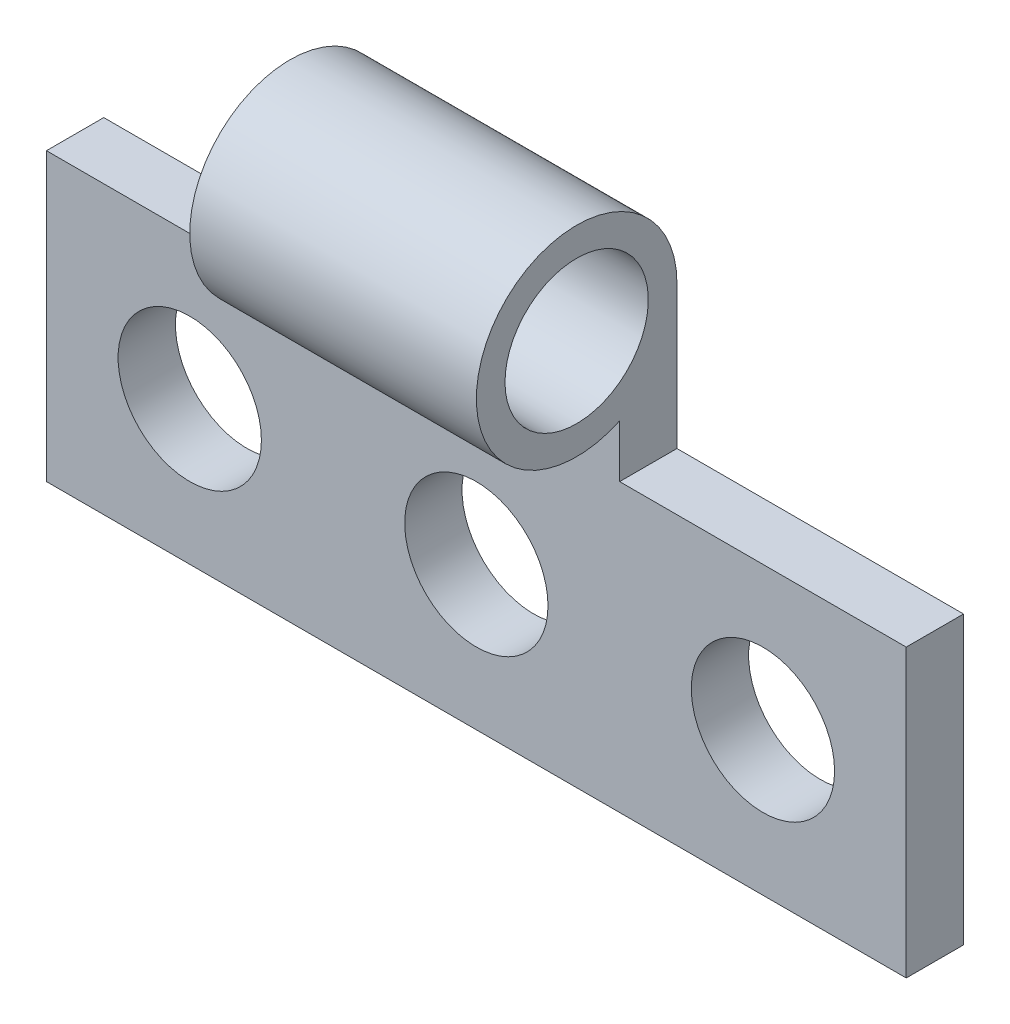
ISO-10303-21;
HEADER;
FILE_DESCRIPTION(('STEP AP214'),'2;1');
FILE_NAME('part.step','',(''),(''),'','','');
FILE_SCHEMA(('AUTOMOTIVE_DESIGN { 1 0 10303 214 1 1 1 1 }'));
ENDSEC;
DATA;
#1=APPLICATION_CONTEXT('core data for automotive mechanical design processes');
#2=APPLICATION_PROTOCOL_DEFINITION('international standard','automotive_design',2000,#1);
#3=PRODUCT_CONTEXT('',#1,'mechanical');
#4=PRODUCT('Part','Part','',(#3));
#5=PRODUCT_RELATED_PRODUCT_CATEGORY('part','',(#4));
#6=PRODUCT_DEFINITION_FORMATION('','',#4);
#7=PRODUCT_DEFINITION_CONTEXT('part definition',#1,'design');
#8=PRODUCT_DEFINITION('design','',#6,#7);
#9=PRODUCT_DEFINITION_SHAPE('','',#8);
#10=(LENGTH_UNIT() NAMED_UNIT(*) SI_UNIT(.MILLI.,.METRE.));
#11=(NAMED_UNIT(*) PLANE_ANGLE_UNIT() SI_UNIT($,.RADIAN.));
#12=(NAMED_UNIT(*) SI_UNIT($,.STERADIAN.) SOLID_ANGLE_UNIT());
#13=UNCERTAINTY_MEASURE_WITH_UNIT(LENGTH_MEASURE(1.E-05),#10,'distance_accuracy_value','');
#14=(GEOMETRIC_REPRESENTATION_CONTEXT(3) GLOBAL_UNCERTAINTY_ASSIGNED_CONTEXT((#13)) GLOBAL_UNIT_ASSIGNED_CONTEXT((#10,
#11,#12)) REPRESENTATION_CONTEXT('',''));
#15=CARTESIAN_POINT('',(0.,0.,0.));
#16=DIRECTION('',(0.,0.,1.));
#17=DIRECTION('',(1.,0.,0.));
#18=AXIS2_PLACEMENT_3D('',#15,#16,#17);
#19=CARTESIAN_POINT('',(-15.,5.,2.));
#20=DIRECTION('',(0.,-1.,0.));
#21=DIRECTION('',(0.,0.,-1.));
#22=AXIS2_PLACEMENT_3D('',#19,#20,#21);
#23=PLANE('',#22);
#24=DIRECTION('',(0.,0.,1.));
#25=VECTOR('',#24,1.);
#26=CARTESIAN_POINT('',(-5.,5.,0.));
#27=LINE('',#26,#25);
#28=CARTESIAN_POINT('',(-5.,5.,0.));
#29=VERTEX_POINT('',#28);
#30=CARTESIAN_POINT('',(-5.,5.,2.));
#31=VERTEX_POINT('',#30);
#32=EDGE_CURVE('E63',#29,#31,#27,.T.);
#33=ORIENTED_EDGE('',*,*,#32,.F.);
#34=DIRECTION('',(-1.,0.,0.));
#35=VECTOR('',#34,1.);
#36=CARTESIAN_POINT('',(-15.,5.,0.));
#37=LINE('',#36,#35);
#38=CARTESIAN_POINT('',(-15.,5.,0.));
#39=VERTEX_POINT('',#38);
#40=EDGE_CURVE('E158',#29,#39,#37,.T.);
#41=ORIENTED_EDGE('',*,*,#40,.T.);
#42=DIRECTION('',(0.,0.,-1.));
#43=VECTOR('',#42,1.);
#44=CARTESIAN_POINT('',(-15.,5.,2.));
#45=LINE('',#44,#43);
#46=CARTESIAN_POINT('',(-15.,5.,2.));
#47=VERTEX_POINT('',#46);
#48=EDGE_CURVE('E47',#47,#39,#45,.T.);
#49=ORIENTED_EDGE('',*,*,#48,.F.);
#50=DIRECTION('',(-1.,0.,0.));
#51=VECTOR('',#50,1.);
#52=CARTESIAN_POINT('',(-15.,5.,2.));
#53=LINE('',#52,#51);
#54=EDGE_CURVE('E148',#31,#47,#53,.T.);
#55=ORIENTED_EDGE('',*,*,#54,.F.);
#56=EDGE_LOOP('',(#33,#41,#49,#55));
#57=FACE_BOUND('',#56,.T.);
#58=ADVANCED_FACE('F38',(#57),#23,.F.);
#59=CARTESIAN_POINT('',(15.,5.,2.));
#60=DIRECTION('',(-1.,0.,0.));
#61=DIRECTION('',(0.,0.,1.));
#62=AXIS2_PLACEMENT_3D('',#59,#60,#61);
#63=PLANE('',#62);
#64=DIRECTION('',(0.,1.,0.));
#65=VECTOR('',#64,1.);
#66=CARTESIAN_POINT('',(15.,5.,0.));
#67=LINE('',#66,#65);
#68=CARTESIAN_POINT('',(15.,-5.,0.));
#69=VERTEX_POINT('',#68);
#70=CARTESIAN_POINT('',(15.,5.,0.));
#71=VERTEX_POINT('',#70);
#72=EDGE_CURVE('E116',#69,#71,#67,.T.);
#73=ORIENTED_EDGE('',*,*,#72,.T.);
#74=DIRECTION('',(0.,0.,-1.));
#75=VECTOR('',#74,1.);
#76=CARTESIAN_POINT('',(15.,5.,2.));
#77=LINE('',#76,#75);
#78=CARTESIAN_POINT('',(15.,5.,2.));
#79=VERTEX_POINT('',#78);
#80=EDGE_CURVE('E11',#79,#71,#77,.T.);
#81=ORIENTED_EDGE('',*,*,#80,.F.);
#82=DIRECTION('',(0.,1.,0.));
#83=VECTOR('',#82,1.);
#84=CARTESIAN_POINT('',(15.,5.,2.));
#85=LINE('',#84,#83);
#86=CARTESIAN_POINT('',(15.,-5.,2.));
#87=VERTEX_POINT('',#86);
#88=EDGE_CURVE('E146',#87,#79,#85,.T.);
#89=ORIENTED_EDGE('',*,*,#88,.F.);
#90=DIRECTION('',(0.,0.,-1.));
#91=VECTOR('',#90,1.);
#92=CARTESIAN_POINT('',(15.,-5.,2.));
#93=LINE('',#92,#91);
#94=EDGE_CURVE('E155',#87,#69,#93,.T.);
#95=ORIENTED_EDGE('',*,*,#94,.T.);
#96=EDGE_LOOP('',(#73,#81,#89,#95));
#97=FACE_BOUND('',#96,.T.);
#98=ADVANCED_FACE('F40',(#97),#63,.F.);
#99=CARTESIAN_POINT('',(4.99999999999999,5.,0.));
#100=VERTEX_POINT('',#99);
#101=EDGE_CURVE('E159',#71,#100,#37,.T.);
#102=ORIENTED_EDGE('',*,*,#101,.T.);
#103=DIRECTION('',(0.,0.,1.));
#104=VECTOR('',#103,1.);
#105=CARTESIAN_POINT('',(5.,5.,0.));
#106=LINE('',#105,#104);
#107=CARTESIAN_POINT('',(4.99999999999999,5.,2.));
#108=VERTEX_POINT('',#107);
#109=EDGE_CURVE('E55',#100,#108,#106,.T.);
#110=ORIENTED_EDGE('',*,*,#109,.T.);
#111=EDGE_CURVE('E128',#79,#108,#53,.T.);
#112=ORIENTED_EDGE('',*,*,#111,.F.);
#113=ORIENTED_EDGE('',*,*,#80,.T.);
#114=EDGE_LOOP('',(#102,#110,#112,#113));
#115=FACE_BOUND('',#114,.T.);
#116=ADVANCED_FACE('F235',(#115),#23,.F.);
#117=CARTESIAN_POINT('',(-15.,5.,2.));
#118=DIRECTION('',(1.,0.,0.));
#119=DIRECTION('',(0.,1.,0.));
#120=AXIS2_PLACEMENT_3D('',#117,#118,#119);
#121=PLANE('',#120);
#122=DIRECTION('',(0.,-1.,0.));
#123=VECTOR('',#122,1.);
#124=CARTESIAN_POINT('',(-15.,5.,0.));
#125=LINE('',#124,#123);
#126=CARTESIAN_POINT('',(-15.,-5.,0.));
#127=VERTEX_POINT('',#126);
#128=EDGE_CURVE('E161',#39,#127,#125,.T.);
#129=ORIENTED_EDGE('',*,*,#128,.T.);
#130=DIRECTION('',(0.,0.,-1.));
#131=VECTOR('',#130,1.);
#132=CARTESIAN_POINT('',(-15.,-5.,2.));
#133=LINE('',#132,#131);
#134=CARTESIAN_POINT('',(-15.,-5.,2.));
#135=VERTEX_POINT('',#134);
#136=EDGE_CURVE('E166',#135,#127,#133,.T.);
#137=ORIENTED_EDGE('',*,*,#136,.F.);
#138=DIRECTION('',(0.,-1.,0.));
#139=VECTOR('',#138,1.);
#140=CARTESIAN_POINT('',(-15.,5.,2.));
#141=LINE('',#140,#139);
#142=EDGE_CURVE('E151',#47,#135,#141,.T.);
#143=ORIENTED_EDGE('',*,*,#142,.F.);
#144=ORIENTED_EDGE('',*,*,#48,.T.);
#145=EDGE_LOOP('',(#129,#137,#143,#144));
#146=FACE_BOUND('',#145,.T.);
#147=ADVANCED_FACE('F229',(#146),#121,.F.);
#148=CARTESIAN_POINT('',(-15.,-5.,2.));
#149=DIRECTION('',(0.,1.,0.));
#150=DIRECTION('',(0.,0.,1.));
#151=AXIS2_PLACEMENT_3D('',#148,#149,#150);
#152=PLANE('',#151);
#153=DIRECTION('',(1.,0.,0.));
#154=VECTOR('',#153,1.);
#155=CARTESIAN_POINT('',(-15.,-5.,0.));
#156=LINE('',#155,#154);
#157=EDGE_CURVE('E149',#127,#69,#156,.T.);
#158=ORIENTED_EDGE('',*,*,#157,.T.);
#159=ORIENTED_EDGE('',*,*,#94,.F.);
#160=DIRECTION('',(1.,0.,0.));
#161=VECTOR('',#160,1.);
#162=CARTESIAN_POINT('',(-15.,-5.,2.));
#163=LINE('',#162,#161);
#164=EDGE_CURVE('E153',#135,#87,#163,.T.);
#165=ORIENTED_EDGE('',*,*,#164,.F.);
#166=ORIENTED_EDGE('',*,*,#136,.T.);
#167=EDGE_LOOP('',(#158,#159,#165,#166));
#168=FACE_BOUND('',#167,.T.);
#169=ADVANCED_FACE('F200',(#168),#152,.F.);
#170=CARTESIAN_POINT('',(0.,0.,2.));
#171=DIRECTION('',(0.,0.,1.));
#172=DIRECTION('',(1.,0.,0.));
#173=AXIS2_PLACEMENT_3D('',#170,#171,#172);
#174=PLANE('',#173);
#175=CARTESIAN_POINT('',(-9.99999999999999,0.,2.));
#176=DIRECTION('',(0.,0.,1.));
#177=DIRECTION('',(1.,0.,0.));
#178=AXIS2_PLACEMENT_3D('',#175,#176,#177);
#179=CIRCLE('',#178,2.5);
#180=CARTESIAN_POINT('',(-7.49999999999999,0.,2.));
#181=VERTEX_POINT('',#180);
#182=EDGE_CURVE('E174',#181,#181,#179,.T.);
#183=ORIENTED_EDGE('',*,*,#182,.F.);
#184=EDGE_LOOP('',(#183));
#185=FACE_BOUND('',#184,.T.);
#186=CARTESIAN_POINT('',(0.,0.,2.));
#187=DIRECTION('',(0.,0.,1.));
#188=DIRECTION('',(1.,0.,0.));
#189=AXIS2_PLACEMENT_3D('',#186,#187,#188);
#190=CIRCLE('',#189,2.5);
#191=CARTESIAN_POINT('',(2.50000000000001,0.,2.));
#192=VERTEX_POINT('',#191);
#193=EDGE_CURVE('E188',#192,#192,#190,.T.);
#194=ORIENTED_EDGE('',*,*,#193,.F.);
#195=EDGE_LOOP('',(#194));
#196=FACE_BOUND('',#195,.T.);
#197=CARTESIAN_POINT('',(10.,0.,2.));
#198=DIRECTION('',(0.,0.,1.));
#199=DIRECTION('',(1.,0.,0.));
#200=AXIS2_PLACEMENT_3D('',#197,#198,#199);
#201=CIRCLE('',#200,2.5);
#202=CARTESIAN_POINT('',(12.5,0.,2.));
#203=VERTEX_POINT('',#202);
#204=EDGE_CURVE('E185',#203,#203,#201,.T.);
#205=ORIENTED_EDGE('',*,*,#204,.F.);
#206=EDGE_LOOP('',(#205));
#207=FACE_BOUND('',#206,.T.);
#208=ORIENTED_EDGE('',*,*,#88,.T.);
#209=ORIENTED_EDGE('',*,*,#111,.T.);
#210=DIRECTION('',(0.,1.,0.));
#211=VECTOR('',#210,1.);
#212=CARTESIAN_POINT('',(5.,5.,2.));
#213=LINE('',#212,#211);
#214=CARTESIAN_POINT('',(5.,6.83772233983162,2.));
#215=VERTEX_POINT('',#214);
#216=EDGE_CURVE('E122',#108,#215,#213,.T.);
#217=ORIENTED_EDGE('',*,*,#216,.T.);
#218=DIRECTION('',(1.,0.,0.));
#219=VECTOR('',#218,1.);
#220=CARTESIAN_POINT('',(-5.,6.83772233983162,2.));
#221=LINE('',#220,#219);
#222=CARTESIAN_POINT('',(-5.,6.83772233983162,2.));
#223=VERTEX_POINT('',#222);
#224=EDGE_CURVE('E106',#223,#215,#221,.T.);
#225=ORIENTED_EDGE('',*,*,#224,.F.);
#226=DIRECTION('',(0.,1.,0.));
#227=VECTOR('',#226,1.);
#228=CARTESIAN_POINT('',(-5.,5.,2.));
#229=LINE('',#228,#227);
#230=EDGE_CURVE('E139',#31,#223,#229,.T.);
#231=ORIENTED_EDGE('',*,*,#230,.F.);
#232=ORIENTED_EDGE('',*,*,#54,.T.);
#233=ORIENTED_EDGE('',*,*,#142,.T.);
#234=ORIENTED_EDGE('',*,*,#164,.T.);
#235=EDGE_LOOP('',(#208,#209,#217,#225,#231,#232,#233,#234));
#236=FACE_BOUND('',#235,.T.);
#237=ADVANCED_FACE('F127',(#185,#196,#207,#236),#174,.T.);
#238=CARTESIAN_POINT('',(0.,0.,0.));
#239=DIRECTION('',(0.,0.,1.));
#240=DIRECTION('',(1.,0.,0.));
#241=AXIS2_PLACEMENT_3D('',#238,#239,#240);
#242=PLANE('',#241);
#243=CARTESIAN_POINT('',(-9.99999999999999,0.,0.));
#244=DIRECTION('',(0.,0.,1.));
#245=DIRECTION('',(1.,0.,0.));
#246=AXIS2_PLACEMENT_3D('',#243,#244,#245);
#247=CIRCLE('',#246,2.5);
#248=CARTESIAN_POINT('',(-7.49999999999999,0.,0.));
#249=VERTEX_POINT('',#248);
#250=EDGE_CURVE('E42',#249,#249,#247,.T.);
#251=ORIENTED_EDGE('',*,*,#250,.T.);
#252=EDGE_LOOP('',(#251));
#253=FACE_BOUND('',#252,.T.);
#254=CARTESIAN_POINT('',(0.,0.,0.));
#255=DIRECTION('',(0.,0.,1.));
#256=DIRECTION('',(1.,0.,0.));
#257=AXIS2_PLACEMENT_3D('',#254,#255,#256);
#258=CIRCLE('',#257,2.5);
#259=CARTESIAN_POINT('',(2.50000000000001,0.,0.));
#260=VERTEX_POINT('',#259);
#261=EDGE_CURVE('E173',#260,#260,#258,.T.);
#262=ORIENTED_EDGE('',*,*,#261,.T.);
#263=EDGE_LOOP('',(#262));
#264=FACE_BOUND('',#263,.T.);
#265=CARTESIAN_POINT('',(10.,0.,0.));
#266=DIRECTION('',(0.,0.,1.));
#267=DIRECTION('',(1.,0.,0.));
#268=AXIS2_PLACEMENT_3D('',#265,#266,#267);
#269=CIRCLE('',#268,2.5);
#270=CARTESIAN_POINT('',(12.5,0.,0.));
#271=VERTEX_POINT('',#270);
#272=EDGE_CURVE('E171',#271,#271,#269,.T.);
#273=ORIENTED_EDGE('',*,*,#272,.T.);
#274=EDGE_LOOP('',(#273));
#275=FACE_BOUND('',#274,.T.);
#276=ORIENTED_EDGE('',*,*,#72,.F.);
#277=ORIENTED_EDGE('',*,*,#157,.F.);
#278=ORIENTED_EDGE('',*,*,#128,.F.);
#279=ORIENTED_EDGE('',*,*,#40,.F.);
#280=DIRECTION('',(0.,-1.,0.));
#281=VECTOR('',#280,1.);
#282=CARTESIAN_POINT('',(-5.,5.,0.));
#283=LINE('',#282,#281);
#284=CARTESIAN_POINT('',(-5.,10.,0.));
#285=VERTEX_POINT('',#284);
#286=EDGE_CURVE('E142',#285,#29,#283,.T.);
#287=ORIENTED_EDGE('',*,*,#286,.F.);
#288=DIRECTION('',(1.,0.,0.));
#289=VECTOR('',#288,1.);
#290=CARTESIAN_POINT('',(-5.,10.,0.));
#291=LINE('',#290,#289);
#292=CARTESIAN_POINT('',(5.,10.,0.));
#293=VERTEX_POINT('',#292);
#294=EDGE_CURVE('E117',#285,#293,#291,.T.);
#295=ORIENTED_EDGE('',*,*,#294,.T.);
#296=DIRECTION('',(0.,-1.,0.));
#297=VECTOR('',#296,1.);
#298=CARTESIAN_POINT('',(5.,5.,0.));
#299=LINE('',#298,#297);
#300=EDGE_CURVE('E124',#293,#100,#299,.T.);
#301=ORIENTED_EDGE('',*,*,#300,.T.);
#302=ORIENTED_EDGE('',*,*,#101,.F.);
#303=EDGE_LOOP('',(#276,#277,#278,#279,#287,#295,#301,#302));
#304=FACE_BOUND('',#303,.T.);
#305=ADVANCED_FACE('F199',(#253,#264,#275,#304),#242,.F.);
#306=CARTESIAN_POINT('',(-5.,10.,3.5));
#307=DIRECTION('',(-1.,0.,0.));
#308=DIRECTION('',(0.,0.,1.));
#309=AXIS2_PLACEMENT_3D('',#306,#307,#308);
#310=PLANE('',#309);
#311=ORIENTED_EDGE('',*,*,#32,.T.);
#312=ORIENTED_EDGE('',*,*,#230,.T.);
#313=CARTESIAN_POINT('',(-5.,10.,3.5));
#314=DIRECTION('',(-1.,0.,0.));
#315=DIRECTION('',(0.,0.,1.));
#316=AXIS2_PLACEMENT_3D('',#313,#314,#315);
#317=CIRCLE('',#316,3.5);
#318=EDGE_CURVE('E112',#223,#285,#317,.T.);
#319=ORIENTED_EDGE('',*,*,#318,.T.);
#320=ORIENTED_EDGE('',*,*,#286,.T.);
#321=EDGE_LOOP('',(#311,#312,#319,#320));
#322=FACE_BOUND('',#321,.T.);
#323=CARTESIAN_POINT('',(-5.,10.,3.5));
#324=DIRECTION('',(-1.,0.,0.));
#325=DIRECTION('',(0.,0.,1.));
#326=AXIS2_PLACEMENT_3D('',#323,#324,#325);
#327=CIRCLE('',#326,2.5);
#328=CARTESIAN_POINT('',(-5.,10.,6.));
#329=VERTEX_POINT('',#328);
#330=EDGE_CURVE('E135',#329,#329,#327,.T.);
#331=ORIENTED_EDGE('',*,*,#330,.F.);
#332=EDGE_LOOP('',(#331));
#333=FACE_BOUND('',#332,.T.);
#334=ADVANCED_FACE('F215',(#322,#333),#310,.T.);
#335=CARTESIAN_POINT('',(-5.,10.,3.5));
#336=DIRECTION('',(1.,0.,0.));
#337=DIRECTION('',(0.,0.,-1.));
#338=AXIS2_PLACEMENT_3D('',#335,#336,#337);
#339=CYLINDRICAL_SURFACE('',#338,3.5);
#340=ORIENTED_EDGE('',*,*,#224,.T.);
#341=CARTESIAN_POINT('',(5.,10.,3.5));
#342=DIRECTION('',(-1.,0.,0.));
#343=DIRECTION('',(0.,0.,1.));
#344=AXIS2_PLACEMENT_3D('',#341,#342,#343);
#345=CIRCLE('',#344,3.5);
#346=EDGE_CURVE('E110',#215,#293,#345,.T.);
#347=ORIENTED_EDGE('',*,*,#346,.T.);
#348=ORIENTED_EDGE('',*,*,#294,.F.);
#349=ORIENTED_EDGE('',*,*,#318,.F.);
#350=EDGE_LOOP('',(#340,#347,#348,#349));
#351=FACE_BOUND('',#350,.T.);
#352=ADVANCED_FACE('F108',(#351),#339,.T.);
#353=CARTESIAN_POINT('',(-5.,10.,3.5));
#354=DIRECTION('',(1.,0.,0.));
#355=DIRECTION('',(0.,0.,-1.));
#356=AXIS2_PLACEMENT_3D('',#353,#354,#355);
#357=CYLINDRICAL_SURFACE('',#356,2.5);
#358=ORIENTED_EDGE('',*,*,#330,.T.);
#359=EDGE_LOOP('',(#358));
#360=FACE_BOUND('',#359,.T.);
#361=CARTESIAN_POINT('',(5.,10.,3.5));
#362=DIRECTION('',(-1.,0.,0.));
#363=DIRECTION('',(0.,0.,1.));
#364=AXIS2_PLACEMENT_3D('',#361,#362,#363);
#365=CIRCLE('',#364,2.5);
#366=CARTESIAN_POINT('',(5.,10.,6.));
#367=VERTEX_POINT('',#366);
#368=EDGE_CURVE('E130',#367,#367,#365,.T.);
#369=ORIENTED_EDGE('',*,*,#368,.F.);
#370=EDGE_LOOP('',(#369));
#371=FACE_BOUND('',#370,.T.);
#372=ADVANCED_FACE('F251',(#360,#371),#357,.F.);
#373=CARTESIAN_POINT('',(5.,10.,3.5));
#374=DIRECTION('',(-1.,0.,0.));
#375=DIRECTION('',(0.,0.,1.));
#376=AXIS2_PLACEMENT_3D('',#373,#374,#375);
#377=PLANE('',#376);
#378=ORIENTED_EDGE('',*,*,#368,.T.);
#379=EDGE_LOOP('',(#378));
#380=FACE_BOUND('',#379,.T.);
#381=ORIENTED_EDGE('',*,*,#109,.F.);
#382=ORIENTED_EDGE('',*,*,#300,.F.);
#383=ORIENTED_EDGE('',*,*,#346,.F.);
#384=ORIENTED_EDGE('',*,*,#216,.F.);
#385=EDGE_LOOP('',(#381,#382,#383,#384));
#386=FACE_BOUND('',#385,.T.);
#387=ADVANCED_FACE('F121',(#380,#386),#377,.F.);
#388=CARTESIAN_POINT('',(10.,0.,-8.));
#389=DIRECTION('',(0.,0.,1.));
#390=DIRECTION('',(1.,0.,0.));
#391=AXIS2_PLACEMENT_3D('',#388,#389,#390);
#392=CYLINDRICAL_SURFACE('',#391,2.5);
#393=ORIENTED_EDGE('',*,*,#204,.T.);
#394=EDGE_LOOP('',(#393));
#395=FACE_BOUND('',#394,.T.);
#396=ORIENTED_EDGE('',*,*,#272,.F.);
#397=EDGE_LOOP('',(#396));
#398=FACE_BOUND('',#397,.T.);
#399=ADVANCED_FACE('F206',(#395,#398),#392,.F.);
#400=CARTESIAN_POINT('',(0.,0.,-8.));
#401=DIRECTION('',(0.,0.,1.));
#402=DIRECTION('',(1.,0.,0.));
#403=AXIS2_PLACEMENT_3D('',#400,#401,#402);
#404=CYLINDRICAL_SURFACE('',#403,2.5);
#405=ORIENTED_EDGE('',*,*,#193,.T.);
#406=EDGE_LOOP('',(#405));
#407=FACE_BOUND('',#406,.T.);
#408=ORIENTED_EDGE('',*,*,#261,.F.);
#409=EDGE_LOOP('',(#408));
#410=FACE_BOUND('',#409,.T.);
#411=ADVANCED_FACE('F209',(#407,#410),#404,.F.);
#412=CARTESIAN_POINT('',(-9.99999999999999,0.,-8.));
#413=DIRECTION('',(0.,0.,1.));
#414=DIRECTION('',(1.,0.,0.));
#415=AXIS2_PLACEMENT_3D('',#412,#413,#414);
#416=CYLINDRICAL_SURFACE('',#415,2.5);
#417=ORIENTED_EDGE('',*,*,#182,.T.);
#418=EDGE_LOOP('',(#417));
#419=FACE_BOUND('',#418,.T.);
#420=ORIENTED_EDGE('',*,*,#250,.F.);
#421=EDGE_LOOP('',(#420));
#422=FACE_BOUND('',#421,.T.);
#423=ADVANCED_FACE('F194',(#419,#422),#416,.F.);
#424=CLOSED_SHELL('',(#58,#98,#116,#147,#169,#237,#305,#334,#352,#372,#387,#399,#411,#423));
#425=MANIFOLD_SOLID_BREP('B2',#424);
#426=ADVANCED_BREP_SHAPE_REPRESENTATION('',(#18,#425),#14);
#427=SHAPE_DEFINITION_REPRESENTATION(#9,#426);
ENDSEC;
END-ISO-10303-21;
